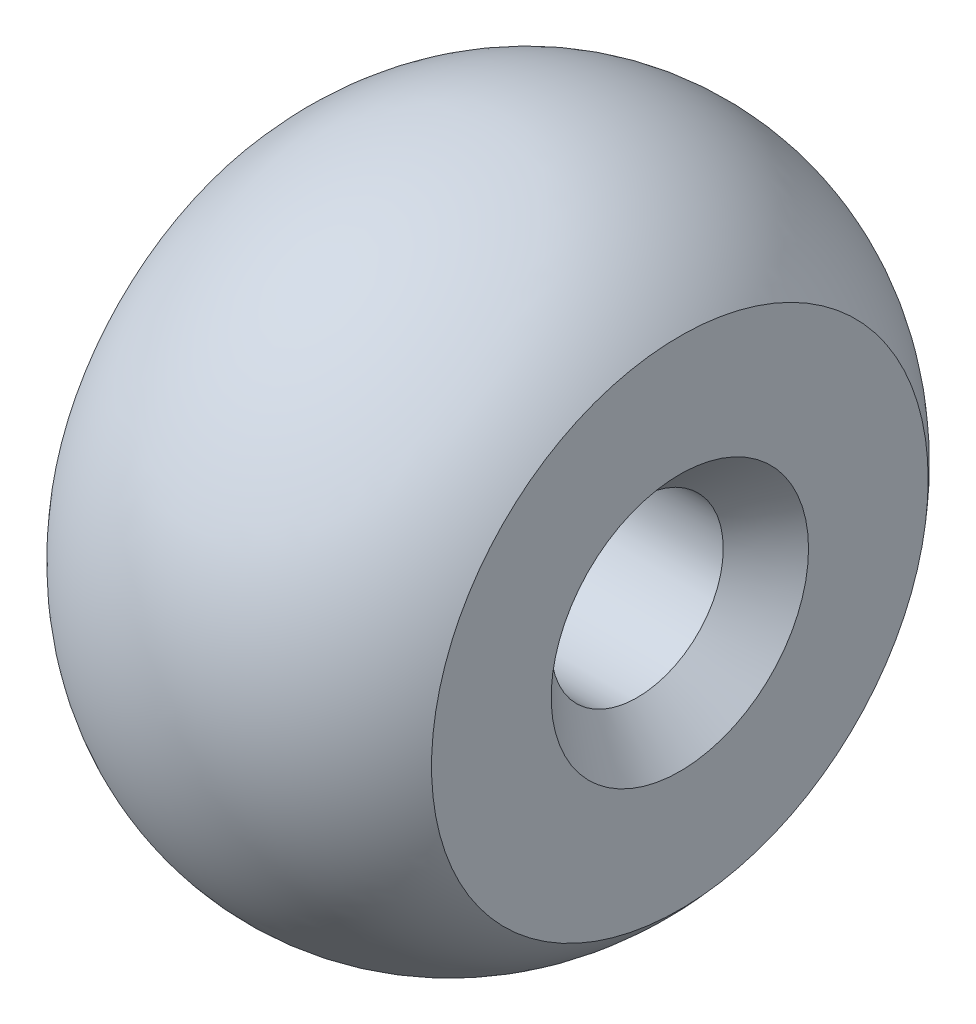
ISO-10303-21;
HEADER;
FILE_DESCRIPTION(('STEP AP214'),'2;1');
FILE_NAME('part.step','',(''),(''),'','','');
FILE_SCHEMA(('AUTOMOTIVE_DESIGN { 1 0 10303 214 1 1 1 1 }'));
ENDSEC;
DATA;
#1=APPLICATION_CONTEXT('core data for automotive mechanical design processes');
#2=APPLICATION_PROTOCOL_DEFINITION('international standard','automotive_design',2000,#1);
#3=PRODUCT_CONTEXT('',#1,'mechanical');
#4=PRODUCT('Part','Part','',(#3));
#5=PRODUCT_RELATED_PRODUCT_CATEGORY('part','',(#4));
#6=PRODUCT_DEFINITION_FORMATION('','',#4);
#7=PRODUCT_DEFINITION_CONTEXT('part definition',#1,'design');
#8=PRODUCT_DEFINITION('design','',#6,#7);
#9=PRODUCT_DEFINITION_SHAPE('','',#8);
#10=(LENGTH_UNIT() NAMED_UNIT(*) SI_UNIT(.MILLI.,.METRE.));
#11=(NAMED_UNIT(*) PLANE_ANGLE_UNIT() SI_UNIT($,.RADIAN.));
#12=(NAMED_UNIT(*) SI_UNIT($,.STERADIAN.) SOLID_ANGLE_UNIT());
#13=UNCERTAINTY_MEASURE_WITH_UNIT(LENGTH_MEASURE(1.E-05),#10,'distance_accuracy_value','');
#14=(GEOMETRIC_REPRESENTATION_CONTEXT(3) GLOBAL_UNCERTAINTY_ASSIGNED_CONTEXT((#13)) GLOBAL_UNIT_ASSIGNED_CONTEXT((#10,
#11,#12)) REPRESENTATION_CONTEXT('',''));
#15=CARTESIAN_POINT('',(0.,0.,0.));
#16=DIRECTION('',(0.,0.,1.));
#17=DIRECTION('',(1.,0.,0.));
#18=AXIS2_PLACEMENT_3D('',#15,#16,#17);
#19=CARTESIAN_POINT('',(-4.5,4.,0.));
#20=DIRECTION('',(-1.,0.,0.));
#21=DIRECTION('',(0.,0.,1.));
#22=AXIS2_PLACEMENT_3D('',#19,#20,#21);
#23=PLANE('',#22);
#24=CARTESIAN_POINT('',(-4.5,1.98181119674381,0.));
#25=DIRECTION('',(1.,0.,0.));
#26=DIRECTION('',(0.,0.,-1.));
#27=AXIS2_PLACEMENT_3D('',#24,#25,#26);
#28=CIRCLE('',#27,2.01818880325619);
#29=CARTESIAN_POINT('',(-4.5,1.98181119674381,-2.01818880325619));
#30=VERTEX_POINT('',#29);
#31=EDGE_CURVE('E47',#30,#30,#28,.T.);
#32=ORIENTED_EDGE('',*,*,#31,.T.);
#33=EDGE_LOOP('',(#32));
#34=FACE_BOUND('',#33,.T.);
#35=CARTESIAN_POINT('',(-4.5,1.98181119674381,0.));
#36=DIRECTION('',(1.,0.,0.));
#37=DIRECTION('',(0.,0.,-1.));
#38=AXIS2_PLACEMENT_3D('',#35,#36,#37);
#39=CIRCLE('',#38,5.82464041615941);
#40=CARTESIAN_POINT('',(-4.5,1.98181119674381,-5.82464041615941));
#41=VERTEX_POINT('',#40);
#42=EDGE_CURVE('E51',#41,#41,#39,.T.);
#43=ORIENTED_EDGE('',*,*,#42,.F.);
#44=EDGE_LOOP('',(#43));
#45=FACE_BOUND('',#44,.T.);
#46=ADVANCED_FACE('F36',(#34,#45),#23,.T.);
#47=CARTESIAN_POINT('',(0.,1.98181119674381,0.));
#48=DIRECTION('',(1.,0.,0.));
#49=DIRECTION('',(0.,0.,-1.));
#50=AXIS2_PLACEMENT_3D('',#47,#48,#49);
#51=DEGENERATE_TOROIDAL_SURFACE('',#50,2.,5.90574925923206,.T.);
#52=ORIENTED_EDGE('',*,*,#42,.T.);
#53=EDGE_LOOP('',(#52));
#54=FACE_BOUND('',#53,.T.);
#55=CARTESIAN_POINT('',(4.5,1.98181119674381,0.));
#56=DIRECTION('',(1.,0.,0.));
#57=DIRECTION('',(0.,0.,-1.));
#58=AXIS2_PLACEMENT_3D('',#55,#56,#57);
#59=CIRCLE('',#58,5.82464041615941);
#60=CARTESIAN_POINT('',(4.5,1.98181119674381,-5.82464041615941));
#61=VERTEX_POINT('',#60);
#62=EDGE_CURVE('E56',#61,#61,#59,.T.);
#63=ORIENTED_EDGE('',*,*,#62,.F.);
#64=EDGE_LOOP('',(#63));
#65=FACE_BOUND('',#64,.T.);
#66=ADVANCED_FACE('F62',(#54,#65),#51,.T.);
#67=CARTESIAN_POINT('',(4.5,4.,0.));
#68=DIRECTION('',(1.,0.,0.));
#69=DIRECTION('',(0.,0.,-1.));
#70=AXIS2_PLACEMENT_3D('',#67,#68,#69);
#71=PLANE('',#70);
#72=CARTESIAN_POINT('',(4.5,1.98181119674381,0.));
#73=DIRECTION('',(1.,0.,0.));
#74=DIRECTION('',(0.,0.,-1.));
#75=AXIS2_PLACEMENT_3D('',#72,#73,#74);
#76=CIRCLE('',#75,3.01818880325619);
#77=CARTESIAN_POINT('',(4.5,1.98181119674381,-3.01818880325619));
#78=VERTEX_POINT('',#77);
#79=EDGE_CURVE('E10',#78,#78,#76,.F.);
#80=ORIENTED_EDGE('',*,*,#79,.T.);
#81=EDGE_LOOP('',(#80));
#82=FACE_BOUND('',#81,.T.);
#83=ORIENTED_EDGE('',*,*,#62,.T.);
#84=EDGE_LOOP('',(#83));
#85=FACE_BOUND('',#84,.T.);
#86=ADVANCED_FACE('F60',(#82,#85),#71,.T.);
#87=CARTESIAN_POINT('',(0.,1.98181119674381,0.));
#88=DIRECTION('',(1.,0.,0.));
#89=DIRECTION('',(0.,0.,-1.));
#90=AXIS2_PLACEMENT_3D('',#87,#88,#89);
#91=CYLINDRICAL_SURFACE('',#90,2.01818880325619);
#92=CARTESIAN_POINT('',(3.5,1.98181119674381,0.));
#93=DIRECTION('',(1.,0.,0.));
#94=DIRECTION('',(0.,0.,-1.));
#95=AXIS2_PLACEMENT_3D('',#92,#93,#94);
#96=CIRCLE('',#95,2.01818880325619);
#97=CARTESIAN_POINT('',(3.5,1.98181119674381,-2.01818880325619));
#98=VERTEX_POINT('',#97);
#99=EDGE_CURVE('E43',#98,#98,#96,.T.);
#100=ORIENTED_EDGE('',*,*,#99,.T.);
#101=EDGE_LOOP('',(#100));
#102=FACE_BOUND('',#101,.T.);
#103=ORIENTED_EDGE('',*,*,#31,.F.);
#104=EDGE_LOOP('',(#103));
#105=FACE_BOUND('',#104,.T.);
#106=ADVANCED_FACE('F70',(#102,#105),#91,.F.);
#107=CARTESIAN_POINT('',(3.5,1.98181119674381,0.));
#108=DIRECTION('',(1.,0.,0.));
#109=DIRECTION('',(0.,0.,-1.));
#110=AXIS2_PLACEMENT_3D('',#107,#108,#109);
#111=CONICAL_SURFACE('',#110,2.01818880325619,0.78539816339745);
#112=ORIENTED_EDGE('',*,*,#79,.F.);
#113=EDGE_LOOP('',(#112));
#114=FACE_BOUND('',#113,.T.);
#115=ORIENTED_EDGE('',*,*,#99,.F.);
#116=EDGE_LOOP('',(#115));
#117=FACE_BOUND('',#116,.T.);
#118=ADVANCED_FACE('F38',(#114,#117),#111,.F.);
#119=CLOSED_SHELL('',(#46,#66,#86,#106,#118));
#120=MANIFOLD_SOLID_BREP('B2',#119);
#121=ADVANCED_BREP_SHAPE_REPRESENTATION('',(#18,#120),#14);
#122=SHAPE_DEFINITION_REPRESENTATION(#9,#121);
ENDSEC;
END-ISO-10303-21;
